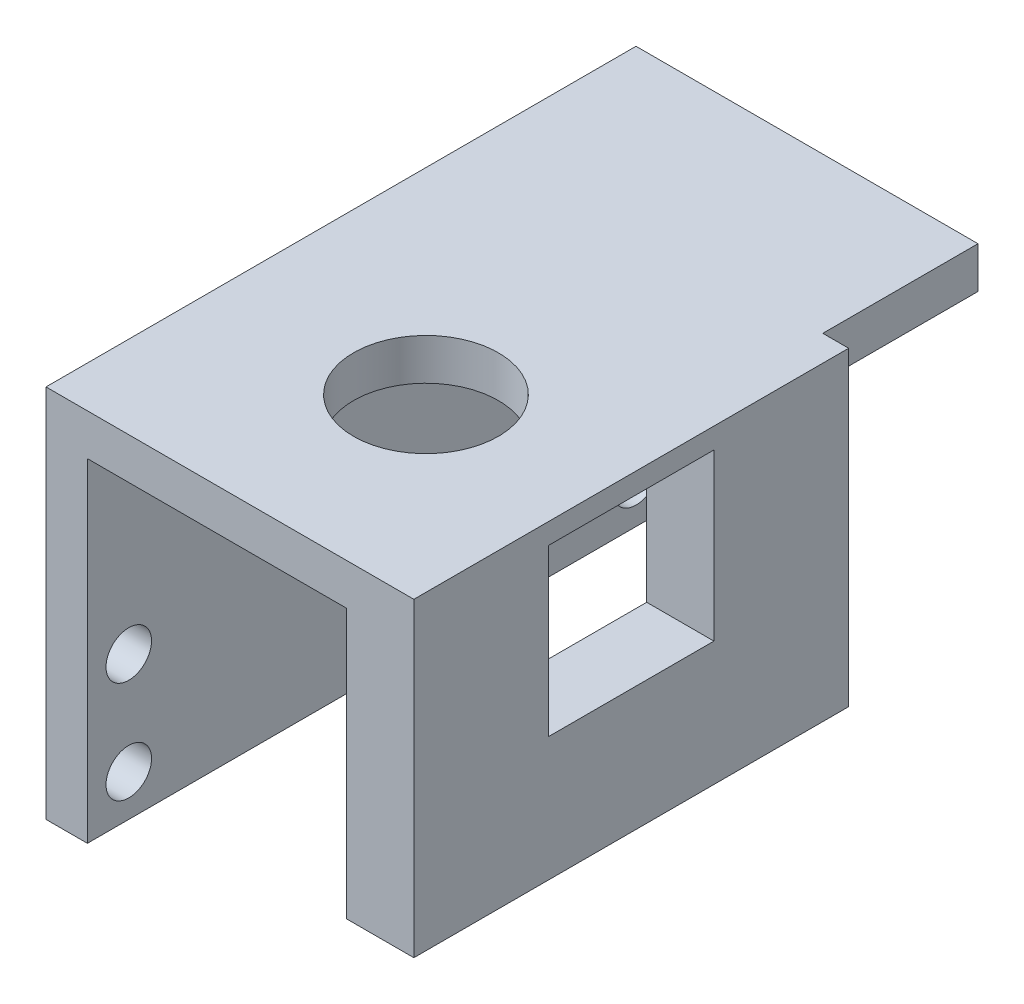
ISO-10303-21;
HEADER;
FILE_DESCRIPTION(('STEP AP214'),'2;1');
FILE_NAME('part.step','',(''),(''),'','','');
FILE_SCHEMA(('AUTOMOTIVE_DESIGN { 1 0 10303 214 1 1 1 1 }'));
ENDSEC;
DATA;
#1=APPLICATION_CONTEXT('core data for automotive mechanical design processes');
#2=APPLICATION_PROTOCOL_DEFINITION('international standard','automotive_design',2000,#1);
#3=PRODUCT_CONTEXT('',#1,'mechanical');
#4=PRODUCT('Part','Part','',(#3));
#5=PRODUCT_RELATED_PRODUCT_CATEGORY('part','',(#4));
#6=PRODUCT_DEFINITION_FORMATION('','',#4);
#7=PRODUCT_DEFINITION_CONTEXT('part definition',#1,'design');
#8=PRODUCT_DEFINITION('design','',#6,#7);
#9=PRODUCT_DEFINITION_SHAPE('','',#8);
#10=(LENGTH_UNIT() NAMED_UNIT(*) SI_UNIT(.MILLI.,.METRE.));
#11=(NAMED_UNIT(*) PLANE_ANGLE_UNIT() SI_UNIT($,.RADIAN.));
#12=(NAMED_UNIT(*) SI_UNIT($,.STERADIAN.) SOLID_ANGLE_UNIT());
#13=UNCERTAINTY_MEASURE_WITH_UNIT(LENGTH_MEASURE(1.E-05),#10,'distance_accuracy_value','');
#14=(GEOMETRIC_REPRESENTATION_CONTEXT(3) GLOBAL_UNCERTAINTY_ASSIGNED_CONTEXT((#13)) GLOBAL_UNIT_ASSIGNED_CONTEXT((#10,
#11,#12)) REPRESENTATION_CONTEXT('',''));
#15=CARTESIAN_POINT('',(0.,0.,0.));
#16=DIRECTION('',(0.,0.,1.));
#17=DIRECTION('',(1.,0.,0.));
#18=AXIS2_PLACEMENT_3D('',#15,#16,#17);
#19=CARTESIAN_POINT('',(33.05,14.1,28.51));
#20=DIRECTION('',(0.,1.,0.));
#21=DIRECTION('',(0.,0.,1.));
#22=AXIS2_PLACEMENT_3D('',#19,#20,#21);
#23=PLANE('',#22);
#24=CARTESIAN_POINT('',(19.,14.1,10.79));
#25=DIRECTION('',(0.,1.,0.));
#26=DIRECTION('',(0.,0.,1.));
#27=AXIS2_PLACEMENT_3D('',#24,#25,#26);
#28=CIRCLE('',#27,7.);
#29=CARTESIAN_POINT('',(19.,14.1,17.79));
#30=VERTEX_POINT('',#29);
#31=EDGE_CURVE('E213',#30,#30,#28,.F.);
#32=ORIENTED_EDGE('',*,*,#31,.F.);
#33=EDGE_LOOP('',(#32));
#34=FACE_BOUND('',#33,.T.);
#35=DIRECTION('',(0.,0.,-1.));
#36=VECTOR('',#35,1.);
#37=CARTESIAN_POINT('',(29.05,14.1,28.51));
#38=LINE('',#37,#36);
#39=CARTESIAN_POINT('',(29.05,14.1,28.51));
#40=VERTEX_POINT('',#39);
#41=CARTESIAN_POINT('',(29.05,14.1,15.51));
#42=VERTEX_POINT('',#41);
#43=EDGE_CURVE('E229',#40,#42,#38,.T.);
#44=ORIENTED_EDGE('',*,*,#43,.F.);
#45=DIRECTION('',(-1.,0.,0.));
#46=VECTOR('',#45,1.);
#47=CARTESIAN_POINT('',(33.05,14.1,28.51));
#48=LINE('',#47,#46);
#49=CARTESIAN_POINT('',(4.,14.1,28.51));
#50=VERTEX_POINT('',#49);
#51=EDGE_CURVE('E261',#40,#50,#48,.T.);
#52=ORIENTED_EDGE('',*,*,#51,.T.);
#53=DIRECTION('',(0.,0.,-1.));
#54=VECTOR('',#53,1.);
#55=CARTESIAN_POINT('',(4.,14.1,28.51));
#56=LINE('',#55,#54);
#57=CARTESIAN_POINT('',(4.,14.1,-28.51));
#58=VERTEX_POINT('',#57);
#59=EDGE_CURVE('E243',#50,#58,#56,.T.);
#60=ORIENTED_EDGE('',*,*,#59,.T.);
#61=DIRECTION('',(-1.,0.,0.));
#62=VECTOR('',#61,1.);
#63=CARTESIAN_POINT('',(33.05,14.1,-28.51));
#64=LINE('',#63,#62);
#65=CARTESIAN_POINT('',(33.05,14.1,-28.51));
#66=VERTEX_POINT('',#65);
#67=EDGE_CURVE('E254',#66,#58,#64,.T.);
#68=ORIENTED_EDGE('',*,*,#67,.F.);
#69=DIRECTION('',(0.,0.,-1.));
#70=VECTOR('',#69,1.);
#71=CARTESIAN_POINT('',(33.05,14.1,28.51));
#72=LINE('',#71,#70);
#73=CARTESIAN_POINT('',(33.05,14.1,-13.51));
#74=VERTEX_POINT('',#73);
#75=EDGE_CURVE('E244',#74,#66,#72,.T.);
#76=ORIENTED_EDGE('',*,*,#75,.F.);
#77=DIRECTION('',(1.,0.,0.));
#78=VECTOR('',#77,1.);
#79=CARTESIAN_POINT('',(33.05,14.1,-13.51));
#80=LINE('',#79,#78);
#81=CARTESIAN_POINT('',(29.05,14.1,-13.51));
#82=VERTEX_POINT('',#81);
#83=EDGE_CURVE('E222',#82,#74,#80,.T.);
#84=ORIENTED_EDGE('',*,*,#83,.F.);
#85=CARTESIAN_POINT('',(29.05,14.1,-0.490000000000001));
#86=VERTEX_POINT('',#85);
#87=EDGE_CURVE('E217',#86,#82,#38,.T.);
#88=ORIENTED_EDGE('',*,*,#87,.F.);
#89=EDGE_CURVE('E233',#42,#86,#38,.T.);
#90=ORIENTED_EDGE('',*,*,#89,.F.);
#91=EDGE_LOOP('',(#44,#52,#60,#68,#76,#84,#88,#90));
#92=FACE_BOUND('',#91,.T.);
#93=ADVANCED_FACE('F41',(#34,#92),#23,.F.);
#94=CARTESIAN_POINT('',(4.,0.,0.));
#95=DIRECTION('',(1.,0.,0.));
#96=DIRECTION('',(0.,0.,-1.));
#97=AXIS2_PLACEMENT_3D('',#94,#95,#96);
#98=PLANE('',#97);
#99=ORIENTED_EDGE('',*,*,#59,.F.);
#100=DIRECTION('',(0.,-1.,0.));
#101=VECTOR('',#100,1.);
#102=CARTESIAN_POINT('',(4.,18.1,28.51));
#103=LINE('',#102,#101);
#104=CARTESIAN_POINT('',(4.,-18.1,28.51));
#105=VERTEX_POINT('',#104);
#106=EDGE_CURVE('E300',#50,#105,#103,.T.);
#107=ORIENTED_EDGE('',*,*,#106,.T.);
#108=DIRECTION('',(0.,0.,-1.));
#109=VECTOR('',#108,1.);
#110=CARTESIAN_POINT('',(4.,-18.1,28.51));
#111=LINE('',#110,#109);
#112=CARTESIAN_POINT('',(4.,-18.1,-28.51));
#113=VERTEX_POINT('',#112);
#114=EDGE_CURVE('E304',#105,#113,#111,.T.);
#115=ORIENTED_EDGE('',*,*,#114,.T.);
#116=DIRECTION('',(0.,1.,0.));
#117=VECTOR('',#116,1.);
#118=CARTESIAN_POINT('',(4.,18.1,-28.51));
#119=LINE('',#118,#117);
#120=EDGE_CURVE('E297',#113,#58,#119,.T.);
#121=ORIENTED_EDGE('',*,*,#120,.T.);
#122=EDGE_LOOP('',(#99,#107,#115,#121));
#123=FACE_BOUND('',#122,.T.);
#124=CARTESIAN_POINT('',(4.,-4.25,-24.51));
#125=DIRECTION('',(1.,0.,0.));
#126=DIRECTION('',(0.,0.,-1.));
#127=AXIS2_PLACEMENT_3D('',#124,#125,#126);
#128=CIRCLE('',#127,2.2);
#129=CARTESIAN_POINT('',(4.,-4.25,-26.71));
#130=VERTEX_POINT('',#129);
#131=EDGE_CURVE('E273',#130,#130,#128,.T.);
#132=ORIENTED_EDGE('',*,*,#131,.F.);
#133=EDGE_LOOP('',(#132));
#134=FACE_BOUND('',#133,.T.);
#135=CARTESIAN_POINT('',(4.,-4.25,24.51));
#136=DIRECTION('',(1.,0.,0.));
#137=DIRECTION('',(0.,0.,-1.));
#138=AXIS2_PLACEMENT_3D('',#135,#136,#137);
#139=CIRCLE('',#138,2.2);
#140=CARTESIAN_POINT('',(4.,-4.25,22.31));
#141=VERTEX_POINT('',#140);
#142=EDGE_CURVE('E289',#141,#141,#139,.T.);
#143=ORIENTED_EDGE('',*,*,#142,.F.);
#144=EDGE_LOOP('',(#143));
#145=FACE_BOUND('',#144,.T.);
#146=CARTESIAN_POINT('',(4.,-14.1,24.51));
#147=DIRECTION('',(1.,0.,0.));
#148=DIRECTION('',(0.,0.,-1.));
#149=AXIS2_PLACEMENT_3D('',#146,#147,#148);
#150=CIRCLE('',#149,2.2);
#151=CARTESIAN_POINT('',(4.,-14.1,22.31));
#152=VERTEX_POINT('',#151);
#153=EDGE_CURVE('E281',#152,#152,#150,.T.);
#154=ORIENTED_EDGE('',*,*,#153,.F.);
#155=EDGE_LOOP('',(#154));
#156=FACE_BOUND('',#155,.T.);
#157=CARTESIAN_POINT('',(4.,-14.1,-24.51));
#158=DIRECTION('',(1.,0.,0.));
#159=DIRECTION('',(0.,0.,-1.));
#160=AXIS2_PLACEMENT_3D('',#157,#158,#159);
#161=CIRCLE('',#160,2.2);
#162=CARTESIAN_POINT('',(4.,-14.1,-26.71));
#163=VERTEX_POINT('',#162);
#164=EDGE_CURVE('E265',#163,#163,#161,.T.);
#165=ORIENTED_EDGE('',*,*,#164,.F.);
#166=EDGE_LOOP('',(#165));
#167=FACE_BOUND('',#166,.T.);
#168=ADVANCED_FACE('F353',(#123,#134,#145,#156,#167),#98,.T.);
#169=CARTESIAN_POINT('',(0.,0.,0.));
#170=DIRECTION('',(1.,0.,0.));
#171=DIRECTION('',(0.,0.,-1.));
#172=AXIS2_PLACEMENT_3D('',#169,#170,#171);
#173=PLANE('',#172);
#174=DIRECTION('',(0.,1.,0.));
#175=VECTOR('',#174,1.);
#176=CARTESIAN_POINT('',(0.,18.1,-28.51));
#177=LINE('',#176,#175);
#178=CARTESIAN_POINT('',(0.,-18.1,-28.51));
#179=VERTEX_POINT('',#178);
#180=CARTESIAN_POINT('',(0.,18.1,-28.51));
#181=VERTEX_POINT('',#180);
#182=EDGE_CURVE('E293',#179,#181,#177,.T.);
#183=ORIENTED_EDGE('',*,*,#182,.F.);
#184=DIRECTION('',(0.,0.,-1.));
#185=VECTOR('',#184,1.);
#186=CARTESIAN_POINT('',(0.,-18.1,28.51));
#187=LINE('',#186,#185);
#188=CARTESIAN_POINT('',(0.,-18.1,28.51));
#189=VERTEX_POINT('',#188);
#190=EDGE_CURVE('E301',#189,#179,#187,.T.);
#191=ORIENTED_EDGE('',*,*,#190,.F.);
#192=DIRECTION('',(0.,-1.,0.));
#193=VECTOR('',#192,1.);
#194=CARTESIAN_POINT('',(0.,18.1,28.51));
#195=LINE('',#194,#193);
#196=CARTESIAN_POINT('',(0.,18.1,28.51));
#197=VERTEX_POINT('',#196);
#198=EDGE_CURVE('E314',#197,#189,#195,.T.);
#199=ORIENTED_EDGE('',*,*,#198,.F.);
#200=DIRECTION('',(0.,0.,1.));
#201=VECTOR('',#200,1.);
#202=CARTESIAN_POINT('',(0.,18.1,28.51));
#203=LINE('',#202,#201);
#204=EDGE_CURVE('E311',#181,#197,#203,.T.);
#205=ORIENTED_EDGE('',*,*,#204,.F.);
#206=EDGE_LOOP('',(#183,#191,#199,#205));
#207=FACE_BOUND('',#206,.T.);
#208=CARTESIAN_POINT('',(0.,-4.25,24.51));
#209=DIRECTION('',(1.,0.,0.));
#210=DIRECTION('',(0.,0.,-1.));
#211=AXIS2_PLACEMENT_3D('',#208,#209,#210);
#212=CIRCLE('',#211,2.2);
#213=CARTESIAN_POINT('',(0.,-4.25,22.31));
#214=VERTEX_POINT('',#213);
#215=EDGE_CURVE('E285',#214,#214,#212,.T.);
#216=ORIENTED_EDGE('',*,*,#215,.T.);
#217=EDGE_LOOP('',(#216));
#218=FACE_BOUND('',#217,.T.);
#219=CARTESIAN_POINT('',(0.,-14.1,24.51));
#220=DIRECTION('',(1.,0.,0.));
#221=DIRECTION('',(0.,0.,-1.));
#222=AXIS2_PLACEMENT_3D('',#219,#220,#221);
#223=CIRCLE('',#222,2.2);
#224=CARTESIAN_POINT('',(0.,-14.1,22.31));
#225=VERTEX_POINT('',#224);
#226=EDGE_CURVE('E277',#225,#225,#223,.T.);
#227=ORIENTED_EDGE('',*,*,#226,.T.);
#228=EDGE_LOOP('',(#227));
#229=FACE_BOUND('',#228,.T.);
#230=CARTESIAN_POINT('',(0.,-4.25,-24.51));
#231=DIRECTION('',(1.,0.,0.));
#232=DIRECTION('',(0.,0.,-1.));
#233=AXIS2_PLACEMENT_3D('',#230,#231,#232);
#234=CIRCLE('',#233,2.2);
#235=CARTESIAN_POINT('',(0.,-4.25,-26.71));
#236=VERTEX_POINT('',#235);
#237=EDGE_CURVE('E269',#236,#236,#234,.T.);
#238=ORIENTED_EDGE('',*,*,#237,.T.);
#239=EDGE_LOOP('',(#238));
#240=FACE_BOUND('',#239,.T.);
#241=CARTESIAN_POINT('',(0.,-14.1,-24.51));
#242=DIRECTION('',(1.,0.,0.));
#243=DIRECTION('',(0.,0.,-1.));
#244=AXIS2_PLACEMENT_3D('',#241,#242,#243);
#245=CIRCLE('',#244,2.2);
#246=CARTESIAN_POINT('',(0.,-14.1,-26.71));
#247=VERTEX_POINT('',#246);
#248=EDGE_CURVE('E264',#247,#247,#245,.T.);
#249=ORIENTED_EDGE('',*,*,#248,.T.);
#250=EDGE_LOOP('',(#249));
#251=FACE_BOUND('',#250,.T.);
#252=ADVANCED_FACE('F343',(#207,#218,#229,#240,#251),#173,.F.);
#253=CARTESIAN_POINT('',(4.,18.1,-28.51));
#254=DIRECTION('',(0.,0.,1.));
#255=DIRECTION('',(1.,0.,0.));
#256=AXIS2_PLACEMENT_3D('',#253,#254,#255);
#257=PLANE('',#256);
#258=ORIENTED_EDGE('',*,*,#182,.T.);
#259=DIRECTION('',(-1.,0.,0.));
#260=VECTOR('',#259,1.);
#261=CARTESIAN_POINT('',(4.,18.1,-28.51));
#262=LINE('',#261,#260);
#263=CARTESIAN_POINT('',(33.05,18.1,-28.51));
#264=VERTEX_POINT('',#263);
#265=EDGE_CURVE('E45',#264,#181,#262,.T.);
#266=ORIENTED_EDGE('',*,*,#265,.F.);
#267=DIRECTION('',(0.,1.,0.));
#268=VECTOR('',#267,1.);
#269=CARTESIAN_POINT('',(33.05,18.1,-28.51));
#270=LINE('',#269,#268);
#271=EDGE_CURVE('E247',#66,#264,#270,.T.);
#272=ORIENTED_EDGE('',*,*,#271,.F.);
#273=ORIENTED_EDGE('',*,*,#67,.T.);
#274=ORIENTED_EDGE('',*,*,#120,.F.);
#275=DIRECTION('',(-1.,0.,0.));
#276=VECTOR('',#275,1.);
#277=CARTESIAN_POINT('',(4.,-18.1,-28.51));
#278=LINE('',#277,#276);
#279=EDGE_CURVE('E307',#113,#179,#278,.T.);
#280=ORIENTED_EDGE('',*,*,#279,.T.);
#281=EDGE_LOOP('',(#258,#266,#272,#273,#274,#280));
#282=FACE_BOUND('',#281,.T.);
#283=ADVANCED_FACE('F43',(#282),#257,.F.);
#284=CARTESIAN_POINT('',(4.,18.1,28.51));
#285=DIRECTION('',(0.,-1.,0.));
#286=DIRECTION('',(0.,0.,-1.));
#287=AXIS2_PLACEMENT_3D('',#284,#285,#286);
#288=PLANE('',#287);
#289=CARTESIAN_POINT('',(19.,18.1,10.79));
#290=DIRECTION('',(0.,1.,0.));
#291=DIRECTION('',(0.,0.,1.));
#292=AXIS2_PLACEMENT_3D('',#289,#290,#291);
#293=CIRCLE('',#292,7.);
#294=CARTESIAN_POINT('',(19.,18.1,17.79));
#295=VERTEX_POINT('',#294);
#296=EDGE_CURVE('E209',#295,#295,#293,.T.);
#297=ORIENTED_EDGE('',*,*,#296,.F.);
#298=EDGE_LOOP('',(#297));
#299=FACE_BOUND('',#298,.T.);
#300=ORIENTED_EDGE('',*,*,#204,.T.);
#301=DIRECTION('',(-1.,0.,0.));
#302=VECTOR('',#301,1.);
#303=CARTESIAN_POINT('',(4.,18.1,28.51));
#304=LINE('',#303,#302);
#305=CARTESIAN_POINT('',(35.55,18.1,28.51));
#306=VERTEX_POINT('',#305);
#307=EDGE_CURVE('E325',#306,#197,#304,.T.);
#308=ORIENTED_EDGE('',*,*,#307,.F.);
#309=DIRECTION('',(0.,0.,1.));
#310=VECTOR('',#309,1.);
#311=CARTESIAN_POINT('',(35.55,18.1,28.51));
#312=LINE('',#311,#310);
#313=CARTESIAN_POINT('',(35.55,18.1,-13.51));
#314=VERTEX_POINT('',#313);
#315=EDGE_CURVE('E201',#314,#306,#312,.T.);
#316=ORIENTED_EDGE('',*,*,#315,.F.);
#317=DIRECTION('',(-1.,0.,0.));
#318=VECTOR('',#317,1.);
#319=CARTESIAN_POINT('',(35.55,18.1,-13.51));
#320=LINE('',#319,#318);
#321=CARTESIAN_POINT('',(33.05,18.1,-13.51));
#322=VERTEX_POINT('',#321);
#323=EDGE_CURVE('E204',#314,#322,#320,.T.);
#324=ORIENTED_EDGE('',*,*,#323,.T.);
#325=DIRECTION('',(0.,0.,1.));
#326=VECTOR('',#325,1.);
#327=CARTESIAN_POINT('',(33.05,18.1,28.51));
#328=LINE('',#327,#326);
#329=EDGE_CURVE('E251',#264,#322,#328,.T.);
#330=ORIENTED_EDGE('',*,*,#329,.F.);
#331=ORIENTED_EDGE('',*,*,#265,.T.);
#332=EDGE_LOOP('',(#300,#308,#316,#324,#330,#331));
#333=FACE_BOUND('',#332,.T.);
#334=ADVANCED_FACE('F335',(#299,#333),#288,.F.);
#335=CARTESIAN_POINT('',(4.,18.1,28.51));
#336=DIRECTION('',(0.,0.,-1.));
#337=DIRECTION('',(0.,1.,0.));
#338=AXIS2_PLACEMENT_3D('',#335,#336,#337);
#339=PLANE('',#338);
#340=ORIENTED_EDGE('',*,*,#198,.T.);
#341=DIRECTION('',(-1.,0.,0.));
#342=VECTOR('',#341,1.);
#343=CARTESIAN_POINT('',(4.,-18.1,28.51));
#344=LINE('',#343,#342);
#345=EDGE_CURVE('E322',#105,#189,#344,.T.);
#346=ORIENTED_EDGE('',*,*,#345,.F.);
#347=ORIENTED_EDGE('',*,*,#106,.F.);
#348=ORIENTED_EDGE('',*,*,#51,.F.);
#349=DIRECTION('',(0.,1.,0.));
#350=VECTOR('',#349,1.);
#351=CARTESIAN_POINT('',(29.05,-11.9,28.51));
#352=LINE('',#351,#350);
#353=CARTESIAN_POINT('',(29.05,-11.9,28.51));
#354=VERTEX_POINT('',#353);
#355=EDGE_CURVE('E240',#354,#40,#352,.T.);
#356=ORIENTED_EDGE('',*,*,#355,.F.);
#357=DIRECTION('',(-1.,0.,0.));
#358=VECTOR('',#357,1.);
#359=CARTESIAN_POINT('',(33.05,-11.9,28.51));
#360=LINE('',#359,#358);
#361=CARTESIAN_POINT('',(35.55,-11.9,28.51));
#362=VERTEX_POINT('',#361);
#363=EDGE_CURVE('E218',#362,#354,#360,.T.);
#364=ORIENTED_EDGE('',*,*,#363,.F.);
#365=DIRECTION('',(0.,-1.,0.));
#366=VECTOR('',#365,1.);
#367=CARTESIAN_POINT('',(35.55,18.1,28.51));
#368=LINE('',#367,#366);
#369=EDGE_CURVE('E189',#306,#362,#368,.T.);
#370=ORIENTED_EDGE('',*,*,#369,.F.);
#371=ORIENTED_EDGE('',*,*,#307,.T.);
#372=EDGE_LOOP('',(#340,#346,#347,#348,#356,#364,#370,#371));
#373=FACE_BOUND('',#372,.T.);
#374=ADVANCED_FACE('F346',(#373),#339,.F.);
#375=CARTESIAN_POINT('',(4.,-18.1,28.51));
#376=DIRECTION('',(0.,1.,0.));
#377=DIRECTION('',(0.,0.,1.));
#378=AXIS2_PLACEMENT_3D('',#375,#376,#377);
#379=PLANE('',#378);
#380=ORIENTED_EDGE('',*,*,#190,.T.);
#381=ORIENTED_EDGE('',*,*,#279,.F.);
#382=ORIENTED_EDGE('',*,*,#114,.F.);
#383=ORIENTED_EDGE('',*,*,#345,.T.);
#384=EDGE_LOOP('',(#380,#381,#382,#383));
#385=FACE_BOUND('',#384,.T.);
#386=ADVANCED_FACE('F350',(#385),#379,.F.);
#387=CARTESIAN_POINT('',(4.,-4.25,24.51));
#388=DIRECTION('',(-1.,0.,0.));
#389=DIRECTION('',(0.,0.,1.));
#390=AXIS2_PLACEMENT_3D('',#387,#388,#389);
#391=CYLINDRICAL_SURFACE('',#390,2.2);
#392=ORIENTED_EDGE('',*,*,#142,.T.);
#393=EDGE_LOOP('',(#392));
#394=FACE_BOUND('',#393,.T.);
#395=ORIENTED_EDGE('',*,*,#215,.F.);
#396=EDGE_LOOP('',(#395));
#397=FACE_BOUND('',#396,.T.);
#398=ADVANCED_FACE('F434',(#394,#397),#391,.F.);
#399=CARTESIAN_POINT('',(4.,-14.1,24.51));
#400=DIRECTION('',(-1.,0.,0.));
#401=DIRECTION('',(0.,0.,1.));
#402=AXIS2_PLACEMENT_3D('',#399,#400,#401);
#403=CYLINDRICAL_SURFACE('',#402,2.2);
#404=ORIENTED_EDGE('',*,*,#153,.T.);
#405=EDGE_LOOP('',(#404));
#406=FACE_BOUND('',#405,.T.);
#407=ORIENTED_EDGE('',*,*,#226,.F.);
#408=EDGE_LOOP('',(#407));
#409=FACE_BOUND('',#408,.T.);
#410=ADVANCED_FACE('F430',(#406,#409),#403,.F.);
#411=CARTESIAN_POINT('',(4.,-4.25,-24.51));
#412=DIRECTION('',(-1.,0.,0.));
#413=DIRECTION('',(0.,0.,1.));
#414=AXIS2_PLACEMENT_3D('',#411,#412,#413);
#415=CYLINDRICAL_SURFACE('',#414,2.2);
#416=ORIENTED_EDGE('',*,*,#131,.T.);
#417=EDGE_LOOP('',(#416));
#418=FACE_BOUND('',#417,.T.);
#419=ORIENTED_EDGE('',*,*,#237,.F.);
#420=EDGE_LOOP('',(#419));
#421=FACE_BOUND('',#420,.T.);
#422=ADVANCED_FACE('F426',(#418,#421),#415,.F.);
#423=CARTESIAN_POINT('',(4.,-14.1,-24.51));
#424=DIRECTION('',(-1.,0.,0.));
#425=DIRECTION('',(0.,0.,1.));
#426=AXIS2_PLACEMENT_3D('',#423,#424,#425);
#427=CYLINDRICAL_SURFACE('',#426,2.2);
#428=ORIENTED_EDGE('',*,*,#164,.T.);
#429=EDGE_LOOP('',(#428));
#430=FACE_BOUND('',#429,.T.);
#431=ORIENTED_EDGE('',*,*,#248,.F.);
#432=EDGE_LOOP('',(#431));
#433=FACE_BOUND('',#432,.T.);
#434=ADVANCED_FACE('F423',(#430,#433),#427,.F.);
#435=CARTESIAN_POINT('',(33.05,0.,0.));
#436=DIRECTION('',(1.,0.,0.));
#437=DIRECTION('',(0.,0.,-1.));
#438=AXIS2_PLACEMENT_3D('',#435,#436,#437);
#439=PLANE('',#438);
#440=DIRECTION('',(0.,1.,0.));
#441=VECTOR('',#440,1.);
#442=CARTESIAN_POINT('',(33.05,18.1,-13.51));
#443=LINE('',#442,#441);
#444=EDGE_CURVE('E11',#74,#322,#443,.T.);
#445=ORIENTED_EDGE('',*,*,#444,.F.);
#446=ORIENTED_EDGE('',*,*,#75,.T.);
#447=ORIENTED_EDGE('',*,*,#271,.T.);
#448=ORIENTED_EDGE('',*,*,#329,.T.);
#449=EDGE_LOOP('',(#445,#446,#447,#448));
#450=FACE_BOUND('',#449,.T.);
#451=ADVANCED_FACE('F380',(#450),#439,.T.);
#452=CARTESIAN_POINT('',(29.05,-11.9,28.51));
#453=DIRECTION('',(1.,0.,0.));
#454=DIRECTION('',(0.,0.,-1.));
#455=AXIS2_PLACEMENT_3D('',#452,#453,#454);
#456=PLANE('',#455);
#457=ORIENTED_EDGE('',*,*,#43,.T.);
#458=DIRECTION('',(0.,1.,0.));
#459=VECTOR('',#458,1.);
#460=CARTESIAN_POINT('',(29.05,16.1,15.51));
#461=LINE('',#460,#459);
#462=CARTESIAN_POINT('',(29.05,0.100000000000003,15.51));
#463=VERTEX_POINT('',#462);
#464=EDGE_CURVE('E190',#463,#42,#461,.T.);
#465=ORIENTED_EDGE('',*,*,#464,.F.);
#466=DIRECTION('',(0.,0.,1.));
#467=VECTOR('',#466,1.);
#468=CARTESIAN_POINT('',(29.05,0.100000000000003,15.51));
#469=LINE('',#468,#467);
#470=CARTESIAN_POINT('',(29.05,0.100000000000003,-0.490000000000004));
#471=VERTEX_POINT('',#470);
#472=EDGE_CURVE('E186',#471,#463,#469,.T.);
#473=ORIENTED_EDGE('',*,*,#472,.F.);
#474=DIRECTION('',(0.,-1.,0.));
#475=VECTOR('',#474,1.);
#476=CARTESIAN_POINT('',(29.05,16.1,-0.490000000000001));
#477=LINE('',#476,#475);
#478=EDGE_CURVE('E157',#86,#471,#477,.T.);
#479=ORIENTED_EDGE('',*,*,#478,.F.);
#480=ORIENTED_EDGE('',*,*,#87,.T.);
#481=DIRECTION('',(0.,1.,0.));
#482=VECTOR('',#481,1.);
#483=CARTESIAN_POINT('',(29.05,-11.9,-13.51));
#484=LINE('',#483,#482);
#485=CARTESIAN_POINT('',(29.05,-11.9,-13.51));
#486=VERTEX_POINT('',#485);
#487=EDGE_CURVE('E228',#486,#82,#484,.T.);
#488=ORIENTED_EDGE('',*,*,#487,.F.);
#489=DIRECTION('',(0.,0.,-1.));
#490=VECTOR('',#489,1.);
#491=CARTESIAN_POINT('',(29.05,-11.9,28.51));
#492=LINE('',#491,#490);
#493=EDGE_CURVE('E221',#354,#486,#492,.T.);
#494=ORIENTED_EDGE('',*,*,#493,.F.);
#495=ORIENTED_EDGE('',*,*,#355,.T.);
#496=EDGE_LOOP('',(#457,#465,#473,#479,#480,#488,#494,#495));
#497=FACE_BOUND('',#496,.T.);
#498=ADVANCED_FACE('F365',(#497),#456,.F.);
#499=CARTESIAN_POINT('',(33.05,-11.9,-13.51));
#500=DIRECTION('',(0.,0.,1.));
#501=DIRECTION('',(1.,0.,0.));
#502=AXIS2_PLACEMENT_3D('',#499,#500,#501);
#503=PLANE('',#502);
#504=ORIENTED_EDGE('',*,*,#83,.T.);
#505=ORIENTED_EDGE('',*,*,#444,.T.);
#506=ORIENTED_EDGE('',*,*,#323,.F.);
#507=DIRECTION('',(0.,1.,0.));
#508=VECTOR('',#507,1.);
#509=CARTESIAN_POINT('',(35.55,18.1,-13.51));
#510=LINE('',#509,#508);
#511=CARTESIAN_POINT('',(35.55,-11.9,-13.51));
#512=VERTEX_POINT('',#511);
#513=EDGE_CURVE('E198',#512,#314,#510,.T.);
#514=ORIENTED_EDGE('',*,*,#513,.F.);
#515=DIRECTION('',(1.,0.,0.));
#516=VECTOR('',#515,1.);
#517=CARTESIAN_POINT('',(33.05,-11.9,-13.51));
#518=LINE('',#517,#516);
#519=EDGE_CURVE('E225',#486,#512,#518,.T.);
#520=ORIENTED_EDGE('',*,*,#519,.F.);
#521=ORIENTED_EDGE('',*,*,#487,.T.);
#522=EDGE_LOOP('',(#504,#505,#506,#514,#520,#521));
#523=FACE_BOUND('',#522,.T.);
#524=ADVANCED_FACE('F376',(#523),#503,.F.);
#525=CARTESIAN_POINT('',(0.,-11.9,0.));
#526=DIRECTION('',(0.,1.,0.));
#527=DIRECTION('',(0.,0.,1.));
#528=AXIS2_PLACEMENT_3D('',#525,#526,#527);
#529=PLANE('',#528);
#530=ORIENTED_EDGE('',*,*,#519,.T.);
#531=DIRECTION('',(0.,0.,-1.));
#532=VECTOR('',#531,1.);
#533=CARTESIAN_POINT('',(35.55,-11.9,28.51));
#534=LINE('',#533,#532);
#535=EDGE_CURVE('E194',#362,#512,#534,.T.);
#536=ORIENTED_EDGE('',*,*,#535,.F.);
#537=ORIENTED_EDGE('',*,*,#363,.T.);
#538=ORIENTED_EDGE('',*,*,#493,.T.);
#539=EDGE_LOOP('',(#530,#536,#537,#538));
#540=FACE_BOUND('',#539,.T.);
#541=ADVANCED_FACE('F370',(#540),#529,.F.);
#542=CARTESIAN_POINT('',(19.,-5.69898987322333,10.79));
#543=DIRECTION('',(0.,1.,0.));
#544=DIRECTION('',(0.,0.,1.));
#545=AXIS2_PLACEMENT_3D('',#542,#543,#544);
#546=CYLINDRICAL_SURFACE('',#545,7.);
#547=ORIENTED_EDGE('',*,*,#31,.T.);
#548=EDGE_LOOP('',(#547));
#549=FACE_BOUND('',#548,.T.);
#550=ORIENTED_EDGE('',*,*,#296,.T.);
#551=EDGE_LOOP('',(#550));
#552=FACE_BOUND('',#551,.T.);
#553=ADVANCED_FACE('F451',(#549,#552),#546,.F.);
#554=CARTESIAN_POINT('',(35.55,0.,0.));
#555=DIRECTION('',(1.,0.,0.));
#556=DIRECTION('',(0.,0.,-1.));
#557=AXIS2_PLACEMENT_3D('',#554,#555,#556);
#558=PLANE('',#557);
#559=DIRECTION('',(0.,-1.,0.));
#560=VECTOR('',#559,1.);
#561=CARTESIAN_POINT('',(35.55,16.1,15.51));
#562=LINE('',#561,#560);
#563=CARTESIAN_POINT('',(35.55,16.1,15.51));
#564=VERTEX_POINT('',#563);
#565=CARTESIAN_POINT('',(35.55,0.100000000000003,15.51));
#566=VERTEX_POINT('',#565);
#567=EDGE_CURVE('E66',#564,#566,#562,.T.);
#568=ORIENTED_EDGE('',*,*,#567,.F.);
#569=DIRECTION('',(0.,0.,1.));
#570=VECTOR('',#569,1.);
#571=CARTESIAN_POINT('',(35.55,16.1,15.51));
#572=LINE('',#571,#570);
#573=CARTESIAN_POINT('',(35.55,16.1,-0.490000000000001));
#574=VERTEX_POINT('',#573);
#575=EDGE_CURVE('E172',#574,#564,#572,.T.);
#576=ORIENTED_EDGE('',*,*,#575,.F.);
#577=DIRECTION('',(0.,1.,0.));
#578=VECTOR('',#577,1.);
#579=CARTESIAN_POINT('',(35.55,16.1,-0.490000000000001));
#580=LINE('',#579,#578);
#581=CARTESIAN_POINT('',(35.55,0.100000000000003,-0.490000000000004));
#582=VERTEX_POINT('',#581);
#583=EDGE_CURVE('E154',#582,#574,#580,.T.);
#584=ORIENTED_EDGE('',*,*,#583,.F.);
#585=DIRECTION('',(0.,0.,-1.));
#586=VECTOR('',#585,1.);
#587=CARTESIAN_POINT('',(35.55,0.100000000000003,15.51));
#588=LINE('',#587,#586);
#589=EDGE_CURVE('E164',#566,#582,#588,.T.);
#590=ORIENTED_EDGE('',*,*,#589,.F.);
#591=EDGE_LOOP('',(#568,#576,#584,#590));
#592=FACE_BOUND('',#591,.T.);
#593=ORIENTED_EDGE('',*,*,#369,.T.);
#594=ORIENTED_EDGE('',*,*,#535,.T.);
#595=ORIENTED_EDGE('',*,*,#513,.T.);
#596=ORIENTED_EDGE('',*,*,#315,.T.);
#597=EDGE_LOOP('',(#593,#594,#595,#596));
#598=FACE_BOUND('',#597,.T.);
#599=ADVANCED_FACE('F169',(#592,#598),#558,.T.);
#600=CARTESIAN_POINT('',(29.05,-11.9,28.51));
#601=DIRECTION('',(1.,0.,0.));
#602=DIRECTION('',(0.,0.,-1.));
#603=AXIS2_PLACEMENT_3D('',#600,#601,#602);
#604=PLANE('',#603);
#605=ORIENTED_EDGE('',*,*,#89,.T.);
#606=CARTESIAN_POINT('',(29.05,16.1,-0.490000000000001));
#607=VERTEX_POINT('',#606);
#608=EDGE_CURVE('E387',#607,#86,#477,.T.);
#609=ORIENTED_EDGE('',*,*,#608,.F.);
#610=DIRECTION('',(0.,0.,-1.));
#611=VECTOR('',#610,1.);
#612=CARTESIAN_POINT('',(29.05,16.1,15.51));
#613=LINE('',#612,#611);
#614=CARTESIAN_POINT('',(29.05,16.1,15.51));
#615=VERTEX_POINT('',#614);
#616=EDGE_CURVE('E390',#615,#607,#613,.T.);
#617=ORIENTED_EDGE('',*,*,#616,.F.);
#618=EDGE_CURVE('E388',#42,#615,#461,.T.);
#619=ORIENTED_EDGE('',*,*,#618,.F.);
#620=EDGE_LOOP('',(#605,#609,#617,#619));
#621=FACE_BOUND('',#620,.T.);
#622=ADVANCED_FACE('F385',(#621),#604,.T.);
#623=CARTESIAN_POINT('',(6.42258300203048,16.1,15.51));
#624=DIRECTION('',(0.,0.,1.));
#625=DIRECTION('',(0.,-1.,0.));
#626=AXIS2_PLACEMENT_3D('',#623,#624,#625);
#627=PLANE('',#626);
#628=ORIENTED_EDGE('',*,*,#464,.T.);
#629=ORIENTED_EDGE('',*,*,#618,.T.);
#630=DIRECTION('',(1.,0.,0.));
#631=VECTOR('',#630,1.);
#632=CARTESIAN_POINT('',(6.42258300203048,16.1,15.51));
#633=LINE('',#632,#631);
#634=EDGE_CURVE('E179',#615,#564,#633,.T.);
#635=ORIENTED_EDGE('',*,*,#634,.T.);
#636=ORIENTED_EDGE('',*,*,#567,.T.);
#637=DIRECTION('',(1.,0.,0.));
#638=VECTOR('',#637,1.);
#639=CARTESIAN_POINT('',(6.42258300203048,0.100000000000003,15.51));
#640=LINE('',#639,#638);
#641=EDGE_CURVE('E161',#463,#566,#640,.T.);
#642=ORIENTED_EDGE('',*,*,#641,.F.);
#643=EDGE_LOOP('',(#628,#629,#635,#636,#642));
#644=FACE_BOUND('',#643,.T.);
#645=ADVANCED_FACE('F399',(#644),#627,.F.);
#646=CARTESIAN_POINT('',(6.42258300203048,16.1,15.51));
#647=DIRECTION('',(0.,1.,0.));
#648=DIRECTION('',(0.,0.,1.));
#649=AXIS2_PLACEMENT_3D('',#646,#647,#648);
#650=PLANE('',#649);
#651=ORIENTED_EDGE('',*,*,#616,.T.);
#652=DIRECTION('',(1.,0.,0.));
#653=VECTOR('',#652,1.);
#654=CARTESIAN_POINT('',(6.42258300203048,16.1,-0.490000000000001));
#655=LINE('',#654,#653);
#656=EDGE_CURVE('E160',#607,#574,#655,.T.);
#657=ORIENTED_EDGE('',*,*,#656,.T.);
#658=ORIENTED_EDGE('',*,*,#575,.T.);
#659=ORIENTED_EDGE('',*,*,#634,.F.);
#660=EDGE_LOOP('',(#651,#657,#658,#659));
#661=FACE_BOUND('',#660,.T.);
#662=ADVANCED_FACE('F402',(#661),#650,.F.);
#663=CARTESIAN_POINT('',(6.42258300203048,16.1,-0.490000000000001));
#664=DIRECTION('',(0.,0.,-1.));
#665=DIRECTION('',(0.,1.,0.));
#666=AXIS2_PLACEMENT_3D('',#663,#664,#665);
#667=PLANE('',#666);
#668=ORIENTED_EDGE('',*,*,#608,.T.);
#669=ORIENTED_EDGE('',*,*,#478,.T.);
#670=DIRECTION('',(1.,0.,0.));
#671=VECTOR('',#670,1.);
#672=CARTESIAN_POINT('',(6.42258300203048,0.100000000000003,-0.490000000000004));
#673=LINE('',#672,#671);
#674=EDGE_CURVE('E58',#471,#582,#673,.T.);
#675=ORIENTED_EDGE('',*,*,#674,.T.);
#676=ORIENTED_EDGE('',*,*,#583,.T.);
#677=ORIENTED_EDGE('',*,*,#656,.F.);
#678=EDGE_LOOP('',(#668,#669,#675,#676,#677));
#679=FACE_BOUND('',#678,.T.);
#680=ADVANCED_FACE('F151',(#679),#667,.F.);
#681=CARTESIAN_POINT('',(6.42258300203048,0.100000000000003,15.51));
#682=DIRECTION('',(0.,-1.,0.));
#683=DIRECTION('',(0.,0.,-1.));
#684=AXIS2_PLACEMENT_3D('',#681,#682,#683);
#685=PLANE('',#684);
#686=ORIENTED_EDGE('',*,*,#472,.T.);
#687=ORIENTED_EDGE('',*,*,#641,.T.);
#688=ORIENTED_EDGE('',*,*,#589,.T.);
#689=ORIENTED_EDGE('',*,*,#674,.F.);
#690=EDGE_LOOP('',(#686,#687,#688,#689));
#691=FACE_BOUND('',#690,.T.);
#692=ADVANCED_FACE('F165',(#691),#685,.F.);
#693=CLOSED_SHELL('',(#93,#168,#252,#283,#334,#374,#386,#398,#410,#422,#434,#451,#498,#524,#541,
#553,#599,#622,#645,#662,#680,#692));
#694=MANIFOLD_SOLID_BREP('B2',#693);
#695=ADVANCED_BREP_SHAPE_REPRESENTATION('',(#18,#694),#14);
#696=SHAPE_DEFINITION_REPRESENTATION(#9,#695);
ENDSEC;
END-ISO-10303-21;
